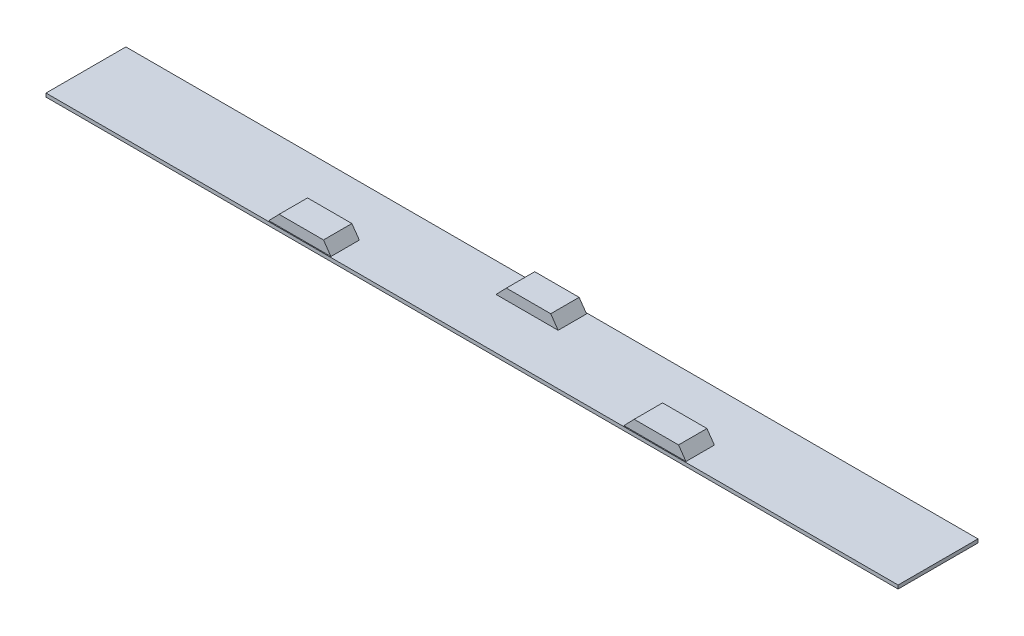
ISO-10303-21;
HEADER;
FILE_DESCRIPTION(('STEP AP214'),'2;1');
FILE_NAME('part.step','',(''),(''),'','','');
FILE_SCHEMA(('AUTOMOTIVE_DESIGN { 1 0 10303 214 1 1 1 1 }'));
ENDSEC;
DATA;
#1=APPLICATION_CONTEXT('core data for automotive mechanical design processes');
#2=APPLICATION_PROTOCOL_DEFINITION('international standard','automotive_design',2000,#1);
#3=PRODUCT_CONTEXT('',#1,'mechanical');
#4=PRODUCT('Part','Part','',(#3));
#5=PRODUCT_RELATED_PRODUCT_CATEGORY('part','',(#4));
#6=PRODUCT_DEFINITION_FORMATION('','',#4);
#7=PRODUCT_DEFINITION_CONTEXT('part definition',#1,'design');
#8=PRODUCT_DEFINITION('design','',#6,#7);
#9=PRODUCT_DEFINITION_SHAPE('','',#8);
#10=(LENGTH_UNIT() NAMED_UNIT(*) SI_UNIT(.MILLI.,.METRE.));
#11=(NAMED_UNIT(*) PLANE_ANGLE_UNIT() SI_UNIT($,.RADIAN.));
#12=(NAMED_UNIT(*) SI_UNIT($,.STERADIAN.) SOLID_ANGLE_UNIT());
#13=UNCERTAINTY_MEASURE_WITH_UNIT(LENGTH_MEASURE(1.E-05),#10,'distance_accuracy_value','');
#14=(GEOMETRIC_REPRESENTATION_CONTEXT(3) GLOBAL_UNCERTAINTY_ASSIGNED_CONTEXT((#13)) GLOBAL_UNIT_ASSIGNED_CONTEXT((#10,
#11,#12)) REPRESENTATION_CONTEXT('',''));
#15=CARTESIAN_POINT('',(0.,0.,0.));
#16=DIRECTION('',(0.,0.,1.));
#17=DIRECTION('',(1.,0.,0.));
#18=AXIS2_PLACEMENT_3D('',#15,#16,#17);
#19=CARTESIAN_POINT('',(0.,10.,0.));
#20=DIRECTION('',(0.,-1.,0.));
#21=DIRECTION('',(0.,0.,-1.));
#22=AXIS2_PLACEMENT_3D('',#19,#20,#21);
#23=PLANE('',#22);
#24=DIRECTION('',(0.,0.,1.));
#25=VECTOR('',#24,1.);
#26=CARTESIAN_POINT('',(-1200.,10.,-112.5));
#27=LINE('',#26,#25);
#28=CARTESIAN_POINT('',(-1200.,10.,-112.5));
#29=VERTEX_POINT('',#28);
#30=CARTESIAN_POINT('',(-1200.,10.,112.5));
#31=VERTEX_POINT('',#30);
#32=EDGE_CURVE('E293',#29,#31,#27,.T.);
#33=ORIENTED_EDGE('',*,*,#32,.T.);
#34=DIRECTION('',(1.,0.,0.));
#35=VECTOR('',#34,1.);
#36=CARTESIAN_POINT('',(1200.,10.,112.5));
#37=LINE('',#36,#35);
#38=CARTESIAN_POINT('',(1200.,10.,112.5));
#39=VERTEX_POINT('',#38);
#40=EDGE_CURVE('E297',#31,#39,#37,.T.);
#41=ORIENTED_EDGE('',*,*,#40,.T.);
#42=DIRECTION('',(0.,0.,-1.));
#43=VECTOR('',#42,1.);
#44=CARTESIAN_POINT('',(1200.,10.,-112.5));
#45=LINE('',#44,#43);
#46=CARTESIAN_POINT('',(1200.,10.,-112.5));
#47=VERTEX_POINT('',#46);
#48=EDGE_CURVE('E301',#39,#47,#45,.T.);
#49=ORIENTED_EDGE('',*,*,#48,.T.);
#50=DIRECTION('',(-1.,0.,0.));
#51=VECTOR('',#50,1.);
#52=CARTESIAN_POINT('',(1200.,10.,-112.5));
#53=LINE('',#52,#51);
#54=EDGE_CURVE('E304',#47,#29,#53,.T.);
#55=ORIENTED_EDGE('',*,*,#54,.T.);
#56=EDGE_LOOP('',(#33,#41,#49,#55));
#57=FACE_BOUND('',#56,.T.);
#58=DIRECTION('',(0.,0.,-1.));
#59=VECTOR('',#58,1.);
#60=CARTESIAN_POINT('',(600.,10.,110.));
#61=LINE('',#60,#59);
#62=CARTESIAN_POINT('',(600.,10.,110.));
#63=VERTEX_POINT('',#62);
#64=CARTESIAN_POINT('',(600.,10.,30.));
#65=VERTEX_POINT('',#64);
#66=EDGE_CURVE('E288',#63,#65,#61,.T.);
#67=ORIENTED_EDGE('',*,*,#66,.F.);
#68=DIRECTION('',(1.,0.,0.));
#69=VECTOR('',#68,1.);
#70=CARTESIAN_POINT('',(425.,10.,110.));
#71=LINE('',#70,#69);
#72=CARTESIAN_POINT('',(425.,10.,110.));
#73=VERTEX_POINT('',#72);
#74=EDGE_CURVE('E251',#73,#63,#71,.T.);
#75=ORIENTED_EDGE('',*,*,#74,.F.);
#76=DIRECTION('',(0.,0.,-1.));
#77=VECTOR('',#76,1.);
#78=CARTESIAN_POINT('',(425.,10.,110.));
#79=LINE('',#78,#77);
#80=CARTESIAN_POINT('',(425.,10.,30.));
#81=VERTEX_POINT('',#80);
#82=EDGE_CURVE('E266',#73,#81,#79,.T.);
#83=ORIENTED_EDGE('',*,*,#82,.T.);
#84=DIRECTION('',(1.,0.,0.));
#85=VECTOR('',#84,1.);
#86=CARTESIAN_POINT('',(425.,10.,30.));
#87=LINE('',#86,#85);
#88=EDGE_CURVE('E238',#81,#65,#87,.T.);
#89=ORIENTED_EDGE('',*,*,#88,.T.);
#90=EDGE_LOOP('',(#67,#75,#83,#89));
#91=FACE_BOUND('',#90,.T.);
#92=DIRECTION('',(0.,0.,-1.));
#93=VECTOR('',#92,1.);
#94=CARTESIAN_POINT('',(-400.,9.99999999999302,110.));
#95=LINE('',#94,#93);
#96=CARTESIAN_POINT('',(-400.000000000005,10.,110.));
#97=VERTEX_POINT('',#96);
#98=CARTESIAN_POINT('',(-400.,10.,30.));
#99=VERTEX_POINT('',#98);
#100=EDGE_CURVE('E69',#97,#99,#95,.T.);
#101=ORIENTED_EDGE('',*,*,#100,.F.);
#102=DIRECTION('',(1.,0.,0.));
#103=VECTOR('',#102,1.);
#104=CARTESIAN_POINT('',(-575.,9.99999999999302,110.));
#105=LINE('',#104,#103);
#106=CARTESIAN_POINT('',(-574.999999999993,10.,110.));
#107=VERTEX_POINT('',#106);
#108=EDGE_CURVE('E229',#107,#97,#105,.T.);
#109=ORIENTED_EDGE('',*,*,#108,.F.);
#110=DIRECTION('',(0.,0.,-1.));
#111=VECTOR('',#110,1.);
#112=CARTESIAN_POINT('',(-575.,9.99999999999302,110.));
#113=LINE('',#112,#111);
#114=CARTESIAN_POINT('',(-575.,9.99999999999302,30.));
#115=VERTEX_POINT('',#114);
#116=EDGE_CURVE('E220',#107,#115,#113,.T.);
#117=ORIENTED_EDGE('',*,*,#116,.T.);
#118=DIRECTION('',(1.,0.,0.));
#119=VECTOR('',#118,1.);
#120=CARTESIAN_POINT('',(-575.,9.99999999999302,30.));
#121=LINE('',#120,#119);
#122=EDGE_CURVE('E235',#115,#99,#121,.T.);
#123=ORIENTED_EDGE('',*,*,#122,.T.);
#124=EDGE_LOOP('',(#101,#109,#117,#123));
#125=FACE_BOUND('',#124,.T.);
#126=DIRECTION('',(1.,0.,0.));
#127=VECTOR('',#126,1.);
#128=CARTESIAN_POINT('',(-75.0000000000002,9.99999999999651,-110.));
#129=LINE('',#128,#127);
#130=CARTESIAN_POINT('',(-75.0000000000002,9.99999999999651,-110.));
#131=VERTEX_POINT('',#130);
#132=CARTESIAN_POINT('',(99.9999999999998,9.99999999999651,-110.));
#133=VERTEX_POINT('',#132);
#134=EDGE_CURVE('E178',#131,#133,#129,.T.);
#135=ORIENTED_EDGE('',*,*,#134,.T.);
#136=DIRECTION('',(0.,0.,1.));
#137=VECTOR('',#136,1.);
#138=CARTESIAN_POINT('',(99.9999999999998,9.99999999999651,-110.));
#139=LINE('',#138,#137);
#140=CARTESIAN_POINT('',(99.9999999999998,9.99999999999651,-30.));
#141=VERTEX_POINT('',#140);
#142=EDGE_CURVE('E161',#133,#141,#139,.T.);
#143=ORIENTED_EDGE('',*,*,#142,.T.);
#144=DIRECTION('',(1.,0.,0.));
#145=VECTOR('',#144,1.);
#146=CARTESIAN_POINT('',(-75.0000000000002,9.99999999999651,-30.));
#147=LINE('',#146,#145);
#148=CARTESIAN_POINT('',(-75.0000000000002,10.,-30.));
#149=VERTEX_POINT('',#148);
#150=EDGE_CURVE('E196',#149,#141,#147,.T.);
#151=ORIENTED_EDGE('',*,*,#150,.F.);
#152=DIRECTION('',(0.,0.,1.));
#153=VECTOR('',#152,1.);
#154=CARTESIAN_POINT('',(-75.0000000000002,9.99999999999651,-110.));
#155=LINE('',#154,#153);
#156=EDGE_CURVE('E185',#131,#149,#155,.T.);
#157=ORIENTED_EDGE('',*,*,#156,.F.);
#158=EDGE_LOOP('',(#135,#143,#151,#157));
#159=FACE_BOUND('',#158,.T.);
#160=ADVANCED_FACE('F45',(#57,#91,#125,#159),#23,.F.);
#161=CARTESIAN_POINT('',(-1200.,10.,-112.5));
#162=DIRECTION('',(1.,0.,0.));
#163=DIRECTION('',(0.,0.,-1.));
#164=AXIS2_PLACEMENT_3D('',#161,#162,#163);
#165=PLANE('',#164);
#166=DIRECTION('',(0.,0.,1.));
#167=VECTOR('',#166,1.);
#168=CARTESIAN_POINT('',(-1200.,0.,-112.5));
#169=LINE('',#168,#167);
#170=CARTESIAN_POINT('',(-1200.,0.,-112.5));
#171=VERTEX_POINT('',#170);
#172=CARTESIAN_POINT('',(-1200.,0.,112.5));
#173=VERTEX_POINT('',#172);
#174=EDGE_CURVE('E292',#171,#173,#169,.T.);
#175=ORIENTED_EDGE('',*,*,#174,.T.);
#176=DIRECTION('',(0.,-1.,0.));
#177=VECTOR('',#176,1.);
#178=CARTESIAN_POINT('',(-1200.,10.,112.5));
#179=LINE('',#178,#177);
#180=EDGE_CURVE('E11',#31,#173,#179,.T.);
#181=ORIENTED_EDGE('',*,*,#180,.F.);
#182=ORIENTED_EDGE('',*,*,#32,.F.);
#183=DIRECTION('',(0.,-1.,0.));
#184=VECTOR('',#183,1.);
#185=CARTESIAN_POINT('',(-1200.,10.,-112.5));
#186=LINE('',#185,#184);
#187=EDGE_CURVE('E307',#29,#171,#186,.T.);
#188=ORIENTED_EDGE('',*,*,#187,.T.);
#189=EDGE_LOOP('',(#175,#181,#182,#188));
#190=FACE_BOUND('',#189,.T.);
#191=ADVANCED_FACE('F47',(#190),#165,.F.);
#192=CARTESIAN_POINT('',(1200.,10.,112.5));
#193=DIRECTION('',(0.,0.,-1.));
#194=DIRECTION('',(-1.,0.,0.));
#195=AXIS2_PLACEMENT_3D('',#192,#193,#194);
#196=PLANE('',#195);
#197=DIRECTION('',(1.,0.,0.));
#198=VECTOR('',#197,1.);
#199=CARTESIAN_POINT('',(1200.,0.,112.5));
#200=LINE('',#199,#198);
#201=CARTESIAN_POINT('',(1200.,0.,112.5));
#202=VERTEX_POINT('',#201);
#203=EDGE_CURVE('E311',#173,#202,#200,.T.);
#204=ORIENTED_EDGE('',*,*,#203,.T.);
#205=DIRECTION('',(0.,-1.,0.));
#206=VECTOR('',#205,1.);
#207=CARTESIAN_POINT('',(1200.,10.,112.5));
#208=LINE('',#207,#206);
#209=EDGE_CURVE('E54',#39,#202,#208,.T.);
#210=ORIENTED_EDGE('',*,*,#209,.F.);
#211=ORIENTED_EDGE('',*,*,#40,.F.);
#212=ORIENTED_EDGE('',*,*,#180,.T.);
#213=EDGE_LOOP('',(#204,#210,#211,#212));
#214=FACE_BOUND('',#213,.T.);
#215=ADVANCED_FACE('F347',(#214),#196,.F.);
#216=CARTESIAN_POINT('',(1200.,10.,-112.5));
#217=DIRECTION('',(-1.,0.,0.));
#218=DIRECTION('',(0.,0.,1.));
#219=AXIS2_PLACEMENT_3D('',#216,#217,#218);
#220=PLANE('',#219);
#221=DIRECTION('',(0.,0.,-1.));
#222=VECTOR('',#221,1.);
#223=CARTESIAN_POINT('',(1200.,0.,-112.5));
#224=LINE('',#223,#222);
#225=CARTESIAN_POINT('',(1200.,0.,-112.5));
#226=VERTEX_POINT('',#225);
#227=EDGE_CURVE('E314',#202,#226,#224,.T.);
#228=ORIENTED_EDGE('',*,*,#227,.T.);
#229=DIRECTION('',(0.,-1.,0.));
#230=VECTOR('',#229,1.);
#231=CARTESIAN_POINT('',(1200.,10.,-112.5));
#232=LINE('',#231,#230);
#233=EDGE_CURVE('E322',#47,#226,#232,.T.);
#234=ORIENTED_EDGE('',*,*,#233,.F.);
#235=ORIENTED_EDGE('',*,*,#48,.F.);
#236=ORIENTED_EDGE('',*,*,#209,.T.);
#237=EDGE_LOOP('',(#228,#234,#235,#236));
#238=FACE_BOUND('',#237,.T.);
#239=ADVANCED_FACE('F331',(#238),#220,.F.);
#240=CARTESIAN_POINT('',(1200.,10.,-112.5));
#241=DIRECTION('',(0.,0.,1.));
#242=DIRECTION('',(1.,0.,0.));
#243=AXIS2_PLACEMENT_3D('',#240,#241,#242);
#244=PLANE('',#243);
#245=DIRECTION('',(-1.,0.,0.));
#246=VECTOR('',#245,1.);
#247=CARTESIAN_POINT('',(1200.,0.,-112.5));
#248=LINE('',#247,#246);
#249=EDGE_CURVE('E298',#226,#171,#248,.T.);
#250=ORIENTED_EDGE('',*,*,#249,.T.);
#251=ORIENTED_EDGE('',*,*,#187,.F.);
#252=ORIENTED_EDGE('',*,*,#54,.F.);
#253=ORIENTED_EDGE('',*,*,#233,.T.);
#254=EDGE_LOOP('',(#250,#251,#252,#253));
#255=FACE_BOUND('',#254,.T.);
#256=ADVANCED_FACE('F340',(#255),#244,.F.);
#257=CARTESIAN_POINT('',(0.,0.,0.));
#258=DIRECTION('',(0.,-1.,0.));
#259=DIRECTION('',(0.,0.,-1.));
#260=AXIS2_PLACEMENT_3D('',#257,#258,#259);
#261=PLANE('',#260);
#262=ORIENTED_EDGE('',*,*,#174,.F.);
#263=ORIENTED_EDGE('',*,*,#249,.F.);
#264=ORIENTED_EDGE('',*,*,#227,.F.);
#265=ORIENTED_EDGE('',*,*,#203,.F.);
#266=EDGE_LOOP('',(#262,#263,#264,#265));
#267=FACE_BOUND('',#266,.T.);
#268=ADVANCED_FACE('F337',(#267),#261,.T.);
#269=CARTESIAN_POINT('',(600.,10.,110.));
#270=DIRECTION('',(-0.820420645133444,-0.571760408771738,0.));
#271=DIRECTION('',(0.571760408771738,-0.820420645133444,0.));
#272=AXIS2_PLACEMENT_3D('',#269,#270,#271);
#273=PLANE('',#272);
#274=DIRECTION('',(-0.571760408771738,0.820420645133443,0.));
#275=VECTOR('',#274,1.);
#276=CARTESIAN_POINT('',(600.,10.,30.));
#277=LINE('',#276,#275);
#278=CARTESIAN_POINT('',(579.092661350127,40.,30.));
#279=VERTEX_POINT('',#278);
#280=EDGE_CURVE('E269',#65,#279,#277,.T.);
#281=ORIENTED_EDGE('',*,*,#280,.T.);
#282=DIRECTION('',(0.,0.,-1.));
#283=VECTOR('',#282,1.);
#284=CARTESIAN_POINT('',(579.092661350127,40.,110.));
#285=LINE('',#284,#283);
#286=CARTESIAN_POINT('',(579.092661350127,40.,110.));
#287=VERTEX_POINT('',#286);
#288=EDGE_CURVE('E284',#287,#279,#285,.T.);
#289=ORIENTED_EDGE('',*,*,#288,.F.);
#290=DIRECTION('',(-0.571760408771738,0.820420645133443,0.));
#291=VECTOR('',#290,1.);
#292=CARTESIAN_POINT('',(600.,10.,110.));
#293=LINE('',#292,#291);
#294=EDGE_CURVE('E255',#63,#287,#293,.T.);
#295=ORIENTED_EDGE('',*,*,#294,.F.);
#296=ORIENTED_EDGE('',*,*,#66,.T.);
#297=EDGE_LOOP('',(#281,#289,#295,#296));
#298=FACE_BOUND('',#297,.T.);
#299=ADVANCED_FACE('F360',(#298),#273,.F.);
#300=CARTESIAN_POINT('',(579.092661350127,40.,110.));
#301=DIRECTION('',(0.,-1.,0.));
#302=DIRECTION('',(0.,0.,-1.));
#303=AXIS2_PLACEMENT_3D('',#300,#301,#302);
#304=PLANE('',#303);
#305=DIRECTION('',(-1.,0.,0.));
#306=VECTOR('',#305,1.);
#307=CARTESIAN_POINT('',(579.092661350127,40.,30.));
#308=LINE('',#307,#306);
#309=CARTESIAN_POINT('',(454.092661350127,40.,30.));
#310=VERTEX_POINT('',#309);
#311=EDGE_CURVE('E272',#279,#310,#308,.T.);
#312=ORIENTED_EDGE('',*,*,#311,.T.);
#313=DIRECTION('',(0.,0.,-1.));
#314=VECTOR('',#313,1.);
#315=CARTESIAN_POINT('',(454.092661350127,40.,110.));
#316=LINE('',#315,#314);
#317=CARTESIAN_POINT('',(454.092661350127,40.,110.));
#318=VERTEX_POINT('',#317);
#319=EDGE_CURVE('E280',#318,#310,#316,.T.);
#320=ORIENTED_EDGE('',*,*,#319,.F.);
#321=DIRECTION('',(-1.,0.,0.));
#322=VECTOR('',#321,1.);
#323=CARTESIAN_POINT('',(579.092661350127,40.,110.));
#324=LINE('',#323,#322);
#325=EDGE_CURVE('E259',#287,#318,#324,.T.);
#326=ORIENTED_EDGE('',*,*,#325,.F.);
#327=ORIENTED_EDGE('',*,*,#288,.T.);
#328=EDGE_LOOP('',(#312,#320,#326,#327));
#329=FACE_BOUND('',#328,.T.);
#330=ADVANCED_FACE('F379',(#329),#304,.F.);
#331=CARTESIAN_POINT('',(454.092661350127,40.,110.));
#332=DIRECTION('',(0.717879437866761,-0.696167445869242,0.));
#333=DIRECTION('',(0.696167445869242,0.717879437866761,0.));
#334=AXIS2_PLACEMENT_3D('',#331,#332,#333);
#335=PLANE('',#334);
#336=DIRECTION('',(-0.696167445869242,-0.717879437866761,0.));
#337=VECTOR('',#336,1.);
#338=CARTESIAN_POINT('',(454.092661350127,40.,30.));
#339=LINE('',#338,#337);
#340=EDGE_CURVE('E256',#310,#81,#339,.T.);
#341=ORIENTED_EDGE('',*,*,#340,.T.);
#342=ORIENTED_EDGE('',*,*,#82,.F.);
#343=DIRECTION('',(-0.696167445869242,-0.717879437866761,0.));
#344=VECTOR('',#343,1.);
#345=CARTESIAN_POINT('',(454.092661350127,40.,110.));
#346=LINE('',#345,#344);
#347=EDGE_CURVE('E262',#318,#73,#346,.T.);
#348=ORIENTED_EDGE('',*,*,#347,.F.);
#349=ORIENTED_EDGE('',*,*,#319,.T.);
#350=EDGE_LOOP('',(#341,#342,#348,#349));
#351=FACE_BOUND('',#350,.T.);
#352=ADVANCED_FACE('F386',(#351),#335,.F.);
#353=CARTESIAN_POINT('',(0.,0.,110.));
#354=DIRECTION('',(0.,0.,1.));
#355=DIRECTION('',(1.,0.,0.));
#356=AXIS2_PLACEMENT_3D('',#353,#354,#355);
#357=PLANE('',#356);
#358=ORIENTED_EDGE('',*,*,#74,.T.);
#359=ORIENTED_EDGE('',*,*,#294,.T.);
#360=ORIENTED_EDGE('',*,*,#325,.T.);
#361=ORIENTED_EDGE('',*,*,#347,.T.);
#362=EDGE_LOOP('',(#358,#359,#360,#361));
#363=FACE_BOUND('',#362,.T.);
#364=ADVANCED_FACE('F393',(#363),#357,.T.);
#365=CARTESIAN_POINT('',(0.,0.,30.));
#366=DIRECTION('',(0.,0.,1.));
#367=DIRECTION('',(1.,0.,0.));
#368=AXIS2_PLACEMENT_3D('',#365,#366,#367);
#369=PLANE('',#368);
#370=ORIENTED_EDGE('',*,*,#88,.F.);
#371=ORIENTED_EDGE('',*,*,#340,.F.);
#372=ORIENTED_EDGE('',*,*,#311,.F.);
#373=ORIENTED_EDGE('',*,*,#280,.F.);
#374=EDGE_LOOP('',(#370,#371,#372,#373));
#375=FACE_BOUND('',#374,.T.);
#376=ADVANCED_FACE('F401',(#375),#369,.F.);
#377=CARTESIAN_POINT('',(-400.,9.99999999999302,110.));
#378=DIRECTION('',(-0.820420645133444,-0.571760408771738,0.));
#379=DIRECTION('',(0.571760408771738,-0.820420645133444,0.));
#380=AXIS2_PLACEMENT_3D('',#377,#378,#379);
#381=PLANE('',#380);
#382=DIRECTION('',(-0.571760408771738,0.820420645133444,0.));
#383=VECTOR('',#382,1.);
#384=CARTESIAN_POINT('',(-400.,9.99999999999302,30.));
#385=LINE('',#384,#383);
#386=CARTESIAN_POINT('',(-420.907338649873,39.999999999993,30.));
#387=VERTEX_POINT('',#386);
#388=EDGE_CURVE('E232',#99,#387,#385,.T.);
#389=ORIENTED_EDGE('',*,*,#388,.T.);
#390=DIRECTION('',(0.,0.,-1.));
#391=VECTOR('',#390,1.);
#392=CARTESIAN_POINT('',(-420.907338649873,39.999999999993,110.));
#393=LINE('',#392,#391);
#394=CARTESIAN_POINT('',(-420.907338649873,39.999999999993,110.));
#395=VERTEX_POINT('',#394);
#396=EDGE_CURVE('E212',#395,#387,#393,.T.);
#397=ORIENTED_EDGE('',*,*,#396,.F.);
#398=DIRECTION('',(-0.571760408771738,0.820420645133444,0.));
#399=VECTOR('',#398,1.);
#400=CARTESIAN_POINT('',(-400.,9.99999999999302,110.));
#401=LINE('',#400,#399);
#402=EDGE_CURVE('E245',#97,#395,#401,.T.);
#403=ORIENTED_EDGE('',*,*,#402,.F.);
#404=ORIENTED_EDGE('',*,*,#100,.T.);
#405=EDGE_LOOP('',(#389,#397,#403,#404));
#406=FACE_BOUND('',#405,.T.);
#407=ADVANCED_FACE('F409',(#406),#381,.F.);
#408=CARTESIAN_POINT('',(-420.907338649873,39.999999999993,110.));
#409=DIRECTION('',(0.,-1.,0.));
#410=DIRECTION('',(0.,0.,-1.));
#411=AXIS2_PLACEMENT_3D('',#408,#409,#410);
#412=PLANE('',#411);
#413=DIRECTION('',(-1.,0.,0.));
#414=VECTOR('',#413,1.);
#415=CARTESIAN_POINT('',(-420.907338649873,39.999999999993,30.));
#416=LINE('',#415,#414);
#417=CARTESIAN_POINT('',(-545.907338649873,39.999999999993,30.));
#418=VERTEX_POINT('',#417);
#419=EDGE_CURVE('E228',#387,#418,#416,.T.);
#420=ORIENTED_EDGE('',*,*,#419,.T.);
#421=DIRECTION('',(0.,0.,-1.));
#422=VECTOR('',#421,1.);
#423=CARTESIAN_POINT('',(-545.907338649873,39.999999999993,110.));
#424=LINE('',#423,#422);
#425=CARTESIAN_POINT('',(-545.907338649873,39.999999999993,110.));
#426=VERTEX_POINT('',#425);
#427=EDGE_CURVE('E216',#426,#418,#424,.T.);
#428=ORIENTED_EDGE('',*,*,#427,.F.);
#429=DIRECTION('',(-1.,0.,0.));
#430=VECTOR('',#429,1.);
#431=CARTESIAN_POINT('',(-420.907338649873,39.999999999993,110.));
#432=LINE('',#431,#430);
#433=EDGE_CURVE('E242',#395,#426,#432,.T.);
#434=ORIENTED_EDGE('',*,*,#433,.F.);
#435=ORIENTED_EDGE('',*,*,#396,.T.);
#436=EDGE_LOOP('',(#420,#428,#434,#435));
#437=FACE_BOUND('',#436,.T.);
#438=ADVANCED_FACE('F417',(#437),#412,.F.);
#439=CARTESIAN_POINT('',(-545.907338649873,39.999999999993,110.));
#440=DIRECTION('',(0.717879437866762,-0.696167445869241,0.));
#441=DIRECTION('',(0.696167445869241,0.717879437866762,0.));
#442=AXIS2_PLACEMENT_3D('',#439,#440,#441);
#443=PLANE('',#442);
#444=DIRECTION('',(-0.696167445869241,-0.717879437866762,0.));
#445=VECTOR('',#444,1.);
#446=CARTESIAN_POINT('',(-545.907338649873,39.999999999993,30.));
#447=LINE('',#446,#445);
#448=EDGE_CURVE('E224',#418,#115,#447,.T.);
#449=ORIENTED_EDGE('',*,*,#448,.T.);
#450=ORIENTED_EDGE('',*,*,#116,.F.);
#451=DIRECTION('',(-0.696167445869241,-0.717879437866762,0.));
#452=VECTOR('',#451,1.);
#453=CARTESIAN_POINT('',(-545.907338649873,39.999999999993,110.));
#454=LINE('',#453,#452);
#455=EDGE_CURVE('E223',#426,#107,#454,.T.);
#456=ORIENTED_EDGE('',*,*,#455,.F.);
#457=ORIENTED_EDGE('',*,*,#427,.T.);
#458=EDGE_LOOP('',(#449,#450,#456,#457));
#459=FACE_BOUND('',#458,.T.);
#460=ADVANCED_FACE('F425',(#459),#443,.F.);
#461=CARTESIAN_POINT('',(0.,0.,110.));
#462=DIRECTION('',(0.,0.,1.));
#463=DIRECTION('',(1.,0.,0.));
#464=AXIS2_PLACEMENT_3D('',#461,#462,#463);
#465=PLANE('',#464);
#466=ORIENTED_EDGE('',*,*,#108,.T.);
#467=ORIENTED_EDGE('',*,*,#402,.T.);
#468=ORIENTED_EDGE('',*,*,#433,.T.);
#469=ORIENTED_EDGE('',*,*,#455,.T.);
#470=EDGE_LOOP('',(#466,#467,#468,#469));
#471=FACE_BOUND('',#470,.T.);
#472=ADVANCED_FACE('F433',(#471),#465,.T.);
#473=CARTESIAN_POINT('',(0.,0.,30.));
#474=DIRECTION('',(0.,0.,1.));
#475=DIRECTION('',(1.,0.,0.));
#476=AXIS2_PLACEMENT_3D('',#473,#474,#475);
#477=PLANE('',#476);
#478=ORIENTED_EDGE('',*,*,#122,.F.);
#479=ORIENTED_EDGE('',*,*,#448,.F.);
#480=ORIENTED_EDGE('',*,*,#419,.F.);
#481=ORIENTED_EDGE('',*,*,#388,.F.);
#482=EDGE_LOOP('',(#478,#479,#480,#481));
#483=FACE_BOUND('',#482,.T.);
#484=ADVANCED_FACE('F441',(#483),#477,.F.);
#485=CARTESIAN_POINT('',(-45.9073386498732,39.9999999999965,-110.));
#486=DIRECTION('',(-0.717879437866761,0.696167445869242,0.));
#487=DIRECTION('',(-0.696167445869242,-0.717879437866761,0.));
#488=AXIS2_PLACEMENT_3D('',#485,#486,#487);
#489=PLANE('',#488);
#490=DIRECTION('',(-0.696167445869242,-0.717879437866761,0.));
#491=VECTOR('',#490,1.);
#492=CARTESIAN_POINT('',(-45.9073386498732,39.9999999999965,-30.));
#493=LINE('',#492,#491);
#494=CARTESIAN_POINT('',(-45.9073386498732,39.9999999999965,-30.));
#495=VERTEX_POINT('',#494);
#496=EDGE_CURVE('E61',#495,#149,#493,.T.);
#497=ORIENTED_EDGE('',*,*,#496,.F.);
#498=DIRECTION('',(0.,0.,1.));
#499=VECTOR('',#498,1.);
#500=CARTESIAN_POINT('',(-45.9073386498732,39.9999999999965,-110.));
#501=LINE('',#500,#499);
#502=CARTESIAN_POINT('',(-45.9073386498732,39.9999999999965,-110.));
#503=VERTEX_POINT('',#502);
#504=EDGE_CURVE('E205',#503,#495,#501,.T.);
#505=ORIENTED_EDGE('',*,*,#504,.F.);
#506=DIRECTION('',(-0.696167445869242,-0.717879437866761,0.));
#507=VECTOR('',#506,1.);
#508=CARTESIAN_POINT('',(-45.9073386498732,39.9999999999965,-110.));
#509=LINE('',#508,#507);
#510=EDGE_CURVE('E172',#503,#131,#509,.T.);
#511=ORIENTED_EDGE('',*,*,#510,.T.);
#512=ORIENTED_EDGE('',*,*,#156,.T.);
#513=EDGE_LOOP('',(#497,#505,#511,#512));
#514=FACE_BOUND('',#513,.T.);
#515=ADVANCED_FACE('F449',(#514),#489,.T.);
#516=CARTESIAN_POINT('',(79.0926613501268,39.9999999999965,-110.));
#517=DIRECTION('',(0.,1.,0.));
#518=DIRECTION('',(0.,0.,1.));
#519=AXIS2_PLACEMENT_3D('',#516,#517,#518);
#520=PLANE('',#519);
#521=DIRECTION('',(-1.,0.,0.));
#522=VECTOR('',#521,1.);
#523=CARTESIAN_POINT('',(79.0926613501268,39.9999999999965,-30.));
#524=LINE('',#523,#522);
#525=CARTESIAN_POINT('',(79.0926613501268,39.9999999999965,-30.));
#526=VERTEX_POINT('',#525);
#527=EDGE_CURVE('E189',#526,#495,#524,.T.);
#528=ORIENTED_EDGE('',*,*,#527,.F.);
#529=DIRECTION('',(0.,0.,1.));
#530=VECTOR('',#529,1.);
#531=CARTESIAN_POINT('',(79.0926613501268,39.9999999999965,-110.));
#532=LINE('',#531,#530);
#533=CARTESIAN_POINT('',(79.0926613501268,39.9999999999965,-110.));
#534=VERTEX_POINT('',#533);
#535=EDGE_CURVE('E171',#534,#526,#532,.T.);
#536=ORIENTED_EDGE('',*,*,#535,.F.);
#537=DIRECTION('',(-1.,0.,0.));
#538=VECTOR('',#537,1.);
#539=CARTESIAN_POINT('',(79.0926613501268,39.9999999999965,-110.));
#540=LINE('',#539,#538);
#541=EDGE_CURVE('E181',#534,#503,#540,.T.);
#542=ORIENTED_EDGE('',*,*,#541,.T.);
#543=ORIENTED_EDGE('',*,*,#504,.T.);
#544=EDGE_LOOP('',(#528,#536,#542,#543));
#545=FACE_BOUND('',#544,.T.);
#546=ADVANCED_FACE('F457',(#545),#520,.T.);
#547=CARTESIAN_POINT('',(99.9999999999998,9.99999999999651,-110.));
#548=DIRECTION('',(0.820420645133444,0.571760408771738,0.));
#549=DIRECTION('',(-0.571760408771738,0.820420645133444,0.));
#550=AXIS2_PLACEMENT_3D('',#547,#548,#549);
#551=PLANE('',#550);
#552=DIRECTION('',(-0.571760408771738,0.820420645133444,0.));
#553=VECTOR('',#552,1.);
#554=CARTESIAN_POINT('',(99.9999999999998,9.99999999999651,-30.));
#555=LINE('',#554,#553);
#556=EDGE_CURVE('E166',#141,#526,#555,.T.);
#557=ORIENTED_EDGE('',*,*,#556,.F.);
#558=ORIENTED_EDGE('',*,*,#142,.F.);
#559=DIRECTION('',(-0.571760408771738,0.820420645133444,0.));
#560=VECTOR('',#559,1.);
#561=CARTESIAN_POINT('',(99.9999999999998,9.99999999999651,-110.));
#562=LINE('',#561,#560);
#563=EDGE_CURVE('E164',#133,#534,#562,.T.);
#564=ORIENTED_EDGE('',*,*,#563,.T.);
#565=ORIENTED_EDGE('',*,*,#535,.T.);
#566=EDGE_LOOP('',(#557,#558,#564,#565));
#567=FACE_BOUND('',#566,.T.);
#568=ADVANCED_FACE('F163',(#567),#551,.T.);
#569=CARTESIAN_POINT('',(0.,0.,-110.));
#570=DIRECTION('',(0.,0.,1.));
#571=DIRECTION('',(1.,0.,0.));
#572=AXIS2_PLACEMENT_3D('',#569,#570,#571);
#573=PLANE('',#572);
#574=ORIENTED_EDGE('',*,*,#134,.F.);
#575=ORIENTED_EDGE('',*,*,#510,.F.);
#576=ORIENTED_EDGE('',*,*,#541,.F.);
#577=ORIENTED_EDGE('',*,*,#563,.F.);
#578=EDGE_LOOP('',(#574,#575,#576,#577));
#579=FACE_BOUND('',#578,.T.);
#580=ADVANCED_FACE('F176',(#579),#573,.F.);
#581=CARTESIAN_POINT('',(0.,0.,-30.));
#582=DIRECTION('',(0.,0.,1.));
#583=DIRECTION('',(1.,0.,0.));
#584=AXIS2_PLACEMENT_3D('',#581,#582,#583);
#585=PLANE('',#584);
#586=ORIENTED_EDGE('',*,*,#150,.T.);
#587=ORIENTED_EDGE('',*,*,#556,.T.);
#588=ORIENTED_EDGE('',*,*,#527,.T.);
#589=ORIENTED_EDGE('',*,*,#496,.T.);
#590=EDGE_LOOP('',(#586,#587,#588,#589));
#591=FACE_BOUND('',#590,.T.);
#592=ADVANCED_FACE('F478',(#591),#585,.T.);
#593=CLOSED_SHELL('',(#160,#191,#215,#239,#256,#268,#299,#330,#352,#364,#376,#407,#438,#460,
#472,#484,#515,#546,#568,#580,#592));
#594=MANIFOLD_SOLID_BREP('B2',#593);
#595=ADVANCED_BREP_SHAPE_REPRESENTATION('',(#18,#594),#14);
#596=SHAPE_DEFINITION_REPRESENTATION(#9,#595);
ENDSEC;
END-ISO-10303-21;
